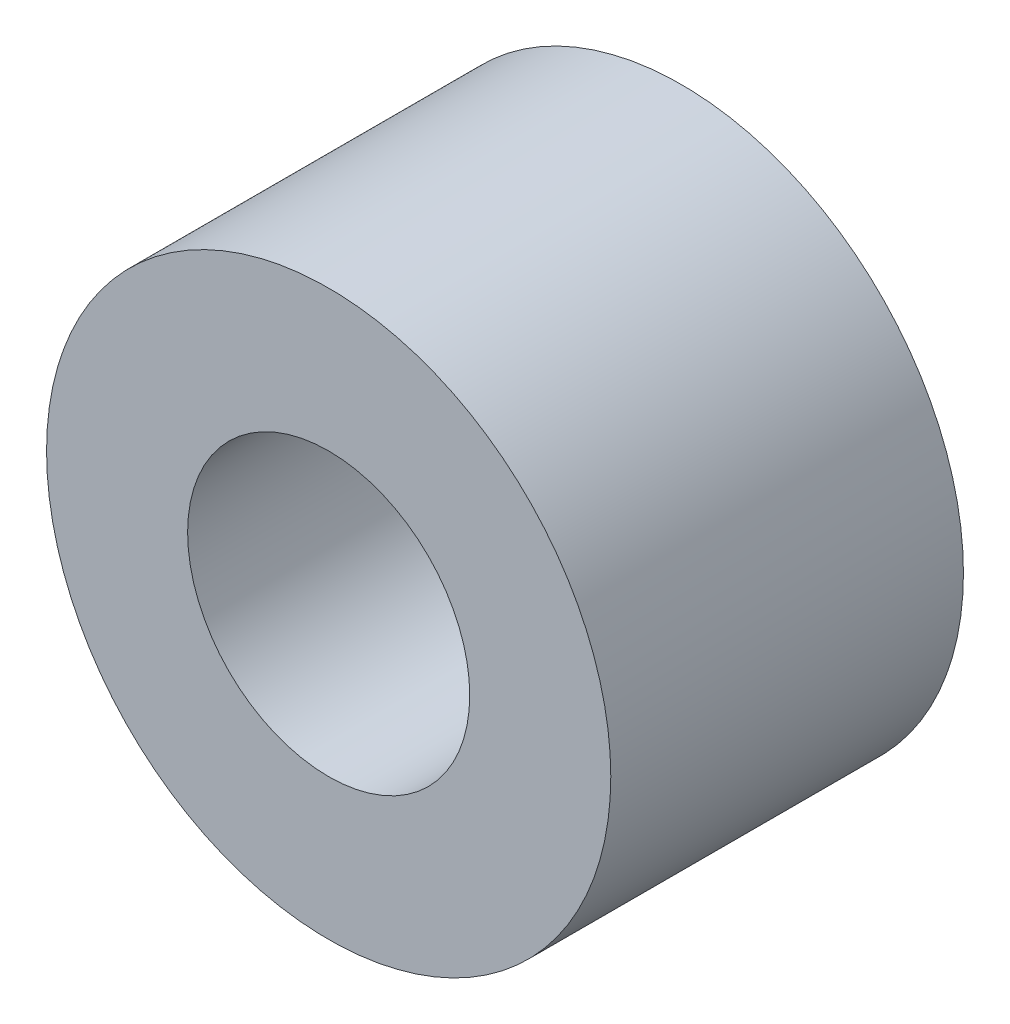
ISO-10303-21;
HEADER;
FILE_DESCRIPTION(('STEP AP214'),'2;1');
FILE_NAME('part.step','',(''),(''),'','','');
FILE_SCHEMA(('AUTOMOTIVE_DESIGN { 1 0 10303 214 1 1 1 1 }'));
ENDSEC;
DATA;
#1=APPLICATION_CONTEXT('core data for automotive mechanical design processes');
#2=APPLICATION_PROTOCOL_DEFINITION('international standard','automotive_design',2000,#1);
#3=PRODUCT_CONTEXT('',#1,'mechanical');
#4=PRODUCT('Part','Part','',(#3));
#5=PRODUCT_RELATED_PRODUCT_CATEGORY('part','',(#4));
#6=PRODUCT_DEFINITION_FORMATION('','',#4);
#7=PRODUCT_DEFINITION_CONTEXT('part definition',#1,'design');
#8=PRODUCT_DEFINITION('design','',#6,#7);
#9=PRODUCT_DEFINITION_SHAPE('','',#8);
#10=(LENGTH_UNIT() NAMED_UNIT(*) SI_UNIT(.MILLI.,.METRE.));
#11=(NAMED_UNIT(*) PLANE_ANGLE_UNIT() SI_UNIT($,.RADIAN.));
#12=(NAMED_UNIT(*) SI_UNIT($,.STERADIAN.) SOLID_ANGLE_UNIT());
#13=UNCERTAINTY_MEASURE_WITH_UNIT(LENGTH_MEASURE(1.E-05),#10,'distance_accuracy_value','');
#14=(GEOMETRIC_REPRESENTATION_CONTEXT(3) GLOBAL_UNCERTAINTY_ASSIGNED_CONTEXT((#13)) GLOBAL_UNIT_ASSIGNED_CONTEXT((#10,
#11,#12)) REPRESENTATION_CONTEXT('',''));
#15=CARTESIAN_POINT('',(0.,0.,0.));
#16=DIRECTION('',(0.,0.,1.));
#17=DIRECTION('',(1.,0.,0.));
#18=AXIS2_PLACEMENT_3D('',#15,#16,#17);
#19=CARTESIAN_POINT('',(2.34486901131573,1.24807544150676,5.));
#20=DIRECTION('',(0.,0.,1.));
#21=DIRECTION('',(1.,0.,0.));
#22=AXIS2_PLACEMENT_3D('',#19,#20,#21);
#23=PLANE('',#22);
#24=CARTESIAN_POINT('',(2.34486901131573,1.24807544150676,5.));
#25=DIRECTION('',(0.,0.,1.));
#26=DIRECTION('',(1.,0.,0.));
#27=AXIS2_PLACEMENT_3D('',#24,#25,#26);
#28=CIRCLE('',#27,4.);
#29=CARTESIAN_POINT('',(6.34486901131573,1.24807544150676,5.));
#30=VERTEX_POINT('',#29);
#31=EDGE_CURVE('E10',#30,#30,#28,.T.);
#32=ORIENTED_EDGE('',*,*,#31,.T.);
#33=EDGE_LOOP('',(#32));
#34=FACE_BOUND('',#33,.T.);
#35=CARTESIAN_POINT('',(2.34486901131573,1.24807544150676,5.));
#36=DIRECTION('',(0.,0.,1.));
#37=DIRECTION('',(1.,0.,0.));
#38=AXIS2_PLACEMENT_3D('',#35,#36,#37);
#39=CIRCLE('',#38,2.);
#40=CARTESIAN_POINT('',(4.34486901131573,1.24807544150676,5.));
#41=VERTEX_POINT('',#40);
#42=EDGE_CURVE('E42',#41,#41,#39,.T.);
#43=ORIENTED_EDGE('',*,*,#42,.F.);
#44=EDGE_LOOP('',(#43));
#45=FACE_BOUND('',#44,.T.);
#46=ADVANCED_FACE('F31',(#34,#45),#23,.T.);
#47=CARTESIAN_POINT('',(2.34486901131573,1.24807544150676,0.));
#48=DIRECTION('',(0.,0.,1.));
#49=DIRECTION('',(1.,0.,0.));
#50=AXIS2_PLACEMENT_3D('',#47,#48,#49);
#51=PLANE('',#50);
#52=CARTESIAN_POINT('',(2.34486901131573,1.24807544150676,0.));
#53=DIRECTION('',(0.,0.,1.));
#54=DIRECTION('',(1.,0.,0.));
#55=AXIS2_PLACEMENT_3D('',#52,#53,#54);
#56=CIRCLE('',#55,4.);
#57=CARTESIAN_POINT('',(6.34486901131573,1.24807544150676,0.));
#58=VERTEX_POINT('',#57);
#59=EDGE_CURVE('E35',#58,#58,#56,.T.);
#60=ORIENTED_EDGE('',*,*,#59,.F.);
#61=EDGE_LOOP('',(#60));
#62=FACE_BOUND('',#61,.T.);
#63=CARTESIAN_POINT('',(2.34486901131573,1.24807544150676,0.));
#64=DIRECTION('',(0.,0.,1.));
#65=DIRECTION('',(1.,0.,0.));
#66=AXIS2_PLACEMENT_3D('',#63,#64,#65);
#67=CIRCLE('',#66,2.);
#68=CARTESIAN_POINT('',(4.34486901131573,1.24807544150676,0.));
#69=VERTEX_POINT('',#68);
#70=EDGE_CURVE('E44',#69,#69,#67,.T.);
#71=ORIENTED_EDGE('',*,*,#70,.T.);
#72=EDGE_LOOP('',(#71));
#73=FACE_BOUND('',#72,.T.);
#74=ADVANCED_FACE('F54',(#62,#73),#51,.F.);
#75=CARTESIAN_POINT('',(2.34486901131573,1.24807544150676,5.));
#76=DIRECTION('',(0.,0.,-1.));
#77=DIRECTION('',(-1.,0.,0.));
#78=AXIS2_PLACEMENT_3D('',#75,#76,#77);
#79=CYLINDRICAL_SURFACE('',#78,4.);
#80=ORIENTED_EDGE('',*,*,#31,.F.);
#81=EDGE_LOOP('',(#80));
#82=FACE_BOUND('',#81,.T.);
#83=ORIENTED_EDGE('',*,*,#59,.T.);
#84=EDGE_LOOP('',(#83));
#85=FACE_BOUND('',#84,.T.);
#86=ADVANCED_FACE('F33',(#82,#85),#79,.T.);
#87=CARTESIAN_POINT('',(2.34486901131573,1.24807544150676,5.));
#88=DIRECTION('',(0.,0.,-1.));
#89=DIRECTION('',(-1.,0.,0.));
#90=AXIS2_PLACEMENT_3D('',#87,#88,#89);
#91=CYLINDRICAL_SURFACE('',#90,2.);
#92=ORIENTED_EDGE('',*,*,#42,.T.);
#93=EDGE_LOOP('',(#92));
#94=FACE_BOUND('',#93,.T.);
#95=ORIENTED_EDGE('',*,*,#70,.F.);
#96=EDGE_LOOP('',(#95));
#97=FACE_BOUND('',#96,.T.);
#98=ADVANCED_FACE('F50',(#94,#97),#91,.F.);
#99=CLOSED_SHELL('',(#46,#74,#86,#98));
#100=MANIFOLD_SOLID_BREP('B2',#99);
#101=ADVANCED_BREP_SHAPE_REPRESENTATION('',(#18,#100),#14);
#102=SHAPE_DEFINITION_REPRESENTATION(#9,#101);
ENDSEC;
END-ISO-10303-21;
